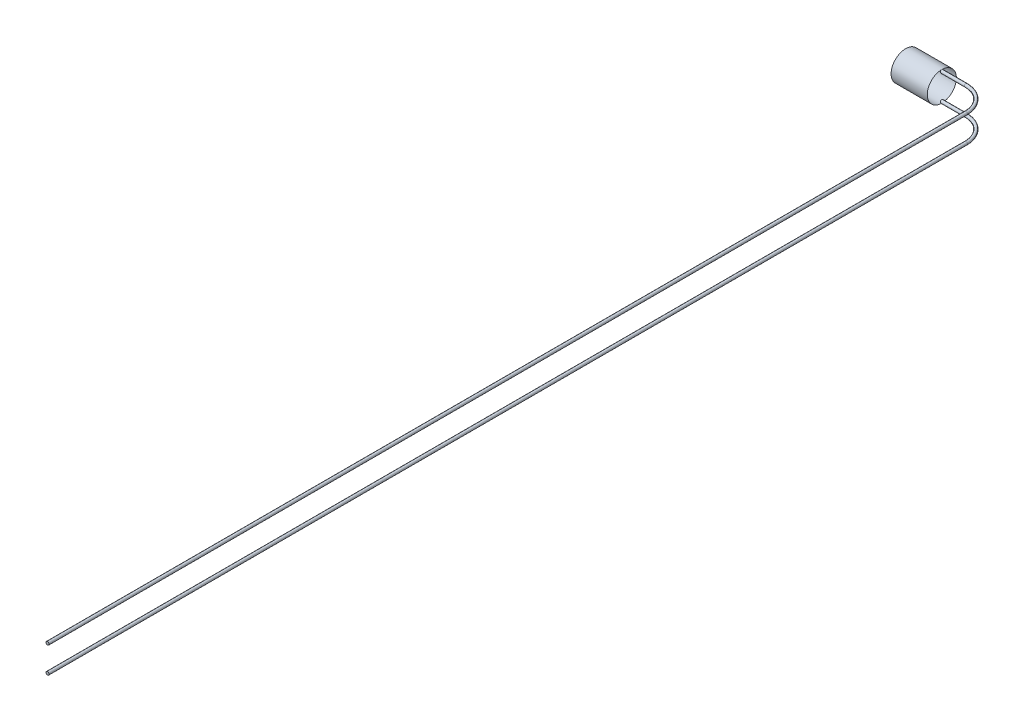
ISO-10303-21;
HEADER;
FILE_DESCRIPTION(('STEP AP214'),'2;1');
FILE_NAME('part.step','',(''),(''),'','','');
FILE_SCHEMA(('AUTOMOTIVE_DESIGN { 1 0 10303 214 1 1 1 1 }'));
ENDSEC;
DATA;
#1=APPLICATION_CONTEXT('core data for automotive mechanical design processes');
#2=APPLICATION_PROTOCOL_DEFINITION('international standard','automotive_design',2000,#1);
#3=PRODUCT_CONTEXT('',#1,'mechanical');
#4=PRODUCT('Part','Part','',(#3));
#5=PRODUCT_RELATED_PRODUCT_CATEGORY('part','',(#4));
#6=PRODUCT_DEFINITION_FORMATION('','',#4);
#7=PRODUCT_DEFINITION_CONTEXT('part definition',#1,'design');
#8=PRODUCT_DEFINITION('design','',#6,#7);
#9=PRODUCT_DEFINITION_SHAPE('','',#8);
#10=(LENGTH_UNIT() NAMED_UNIT(*) SI_UNIT(.MILLI.,.METRE.));
#11=(NAMED_UNIT(*) PLANE_ANGLE_UNIT() SI_UNIT($,.RADIAN.));
#12=(NAMED_UNIT(*) SI_UNIT($,.STERADIAN.) SOLID_ANGLE_UNIT());
#13=UNCERTAINTY_MEASURE_WITH_UNIT(LENGTH_MEASURE(1.E-05),#10,'distance_accuracy_value','');
#14=(GEOMETRIC_REPRESENTATION_CONTEXT(3) GLOBAL_UNCERTAINTY_ASSIGNED_CONTEXT((#13)) GLOBAL_UNIT_ASSIGNED_CONTEXT((#10,
#11,#12)) REPRESENTATION_CONTEXT('',''));
#15=CARTESIAN_POINT('',(0.,0.,0.));
#16=DIRECTION('',(0.,0.,1.));
#17=DIRECTION('',(1.,0.,0.));
#18=AXIS2_PLACEMENT_3D('',#15,#16,#17);
#19=CARTESIAN_POINT('',(0.,1.2065,0.));
#20=DIRECTION('',(-1.,0.,0.));
#21=DIRECTION('',(0.,0.,1.));
#22=AXIS2_PLACEMENT_3D('',#19,#20,#21);
#23=PLANE('',#22);
#24=CARTESIAN_POINT('',(0.,0.,0.));
#25=DIRECTION('',(-1.,0.,0.));
#26=DIRECTION('',(0.,0.,1.));
#27=AXIS2_PLACEMENT_3D('',#24,#25,#26);
#28=CIRCLE('',#27,1.2065);
#29=CARTESIAN_POINT('',(0.,-1.2065,0.));
#30=VERTEX_POINT('',#29);
#31=CARTESIAN_POINT('',(0.,1.2065,0.));
#32=VERTEX_POINT('',#31);
#33=EDGE_CURVE('E39',#30,#32,#28,.T.);
#34=ORIENTED_EDGE('',*,*,#33,.F.);
#35=CARTESIAN_POINT('',(0.,-1.0795,0.));
#36=DIRECTION('',(1.,0.,0.));
#37=DIRECTION('',(0.,0.,-1.));
#38=AXIS2_PLACEMENT_3D('',#35,#36,#37);
#39=CIRCLE('',#38,0.127);
#40=EDGE_CURVE('E50',#30,#30,#39,.T.);
#41=ORIENTED_EDGE('',*,*,#40,.F.);
#42=EDGE_CURVE('E11',#32,#30,#28,.T.);
#43=ORIENTED_EDGE('',*,*,#42,.F.);
#44=CARTESIAN_POINT('',(0.,1.0795,0.));
#45=DIRECTION('',(1.,0.,0.));
#46=DIRECTION('',(0.,0.,-1.));
#47=AXIS2_PLACEMENT_3D('',#44,#45,#46);
#48=CIRCLE('',#47,0.127);
#49=EDGE_CURVE('E52',#32,#32,#48,.T.);
#50=ORIENTED_EDGE('',*,*,#49,.F.);
#51=EDGE_LOOP('',(#34,#41,#43,#50));
#52=FACE_BOUND('',#51,.T.);
#53=ADVANCED_FACE('F31',(#52),#23,.F.);
#54=CARTESIAN_POINT('',(-3.,1.2065,0.));
#55=DIRECTION('',(1.,0.,0.));
#56=DIRECTION('',(0.,0.,-1.));
#57=AXIS2_PLACEMENT_3D('',#54,#55,#56);
#58=PLANE('',#57);
#59=CARTESIAN_POINT('',(-3.,0.,0.));
#60=DIRECTION('',(-1.,0.,0.));
#61=DIRECTION('',(0.,0.,1.));
#62=AXIS2_PLACEMENT_3D('',#59,#60,#61);
#63=CIRCLE('',#62,1.2065);
#64=CARTESIAN_POINT('',(-3.,0.,1.2065));
#65=VERTEX_POINT('',#64);
#66=EDGE_CURVE('E53',#65,#65,#63,.T.);
#67=ORIENTED_EDGE('',*,*,#66,.T.);
#68=EDGE_LOOP('',(#67));
#69=FACE_BOUND('',#68,.T.);
#70=ADVANCED_FACE('F33',(#69),#58,.F.);
#71=CARTESIAN_POINT('',(0.,0.,0.));
#72=DIRECTION('',(-1.,0.,0.));
#73=DIRECTION('',(0.,0.,1.));
#74=AXIS2_PLACEMENT_3D('',#71,#72,#73);
#75=CYLINDRICAL_SURFACE('',#74,1.2065);
#76=ORIENTED_EDGE('',*,*,#66,.F.);
#77=EDGE_LOOP('',(#76));
#78=FACE_BOUND('',#77,.T.);
#79=ORIENTED_EDGE('',*,*,#42,.T.);
#80=ORIENTED_EDGE('',*,*,#33,.T.);
#81=EDGE_LOOP('',(#79,#80));
#82=FACE_BOUND('',#81,.T.);
#83=ADVANCED_FACE('F45',(#78,#82),#75,.T.);
#84=CARTESIAN_POINT('',(4.,1.0795,2.));
#85=DIRECTION('',(0.,0.,1.));
#86=DIRECTION('',(1.,0.,0.));
#87=AXIS2_PLACEMENT_3D('',#84,#85,#86);
#88=CYLINDRICAL_SURFACE('',#87,0.127);
#89=CARTESIAN_POINT('',(4.,1.0795,2.));
#90=DIRECTION('',(0.,0.,1.));
#91=DIRECTION('',(1.,0.,0.));
#92=AXIS2_PLACEMENT_3D('',#89,#90,#91);
#93=CIRCLE('',#92,0.127);
#94=CARTESIAN_POINT('',(4.127,1.0795,2.));
#95=VERTEX_POINT('',#94);
#96=EDGE_CURVE('E59',#95,#95,#93,.T.);
#97=ORIENTED_EDGE('',*,*,#96,.T.);
#98=EDGE_LOOP('',(#97));
#99=FACE_BOUND('',#98,.T.);
#100=CARTESIAN_POINT('',(4.00000000000001,1.0795,78.2));
#101=DIRECTION('',(0.,0.,1.));
#102=DIRECTION('',(1.,0.,0.));
#103=AXIS2_PLACEMENT_3D('',#100,#101,#102);
#104=CIRCLE('',#103,0.127);
#105=CARTESIAN_POINT('',(4.12700000000001,1.0795,78.2));
#106=VERTEX_POINT('',#105);
#107=EDGE_CURVE('E55',#106,#106,#104,.T.);
#108=ORIENTED_EDGE('',*,*,#107,.F.);
#109=EDGE_LOOP('',(#108));
#110=FACE_BOUND('',#109,.T.);
#111=ADVANCED_FACE('F102',(#99,#110),#88,.T.);
#112=CARTESIAN_POINT('',(2.,1.0795,2.));
#113=DIRECTION('',(0.,-1.,0.));
#114=DIRECTION('',(0.,0.,-1.));
#115=AXIS2_PLACEMENT_3D('',#112,#113,#114);
#116=TOROIDAL_SURFACE('',#115,2.,0.127);
#117=CARTESIAN_POINT('',(2.,1.0795,0.));
#118=DIRECTION('',(1.,0.,0.));
#119=DIRECTION('',(0.,0.,-1.));
#120=AXIS2_PLACEMENT_3D('',#117,#118,#119);
#121=CIRCLE('',#120,0.127);
#122=CARTESIAN_POINT('',(2.,1.0795,-0.127));
#123=VERTEX_POINT('',#122);
#124=EDGE_CURVE('E64',#123,#123,#121,.T.);
#125=CARTESIAN_POINT('',(2.,1.0795,2.));
#126=DIRECTION('',(0.,-1.,0.));
#127=DIRECTION('',(0.,0.,-1.));
#128=AXIS2_PLACEMENT_3D('',#125,#126,#127);
#129=CIRCLE('',#128,2.127);
#130=EDGE_CURVE('',#123,#95,#129,.T.);
#131=ORIENTED_EDGE('',*,*,#124,.T.);
#132=ORIENTED_EDGE('',*,*,#96,.F.);
#133=ORIENTED_EDGE('',*,*,#130,.T.);
#134=ORIENTED_EDGE('',*,*,#130,.F.);
#135=EDGE_LOOP('',(#131,#133,#132,#134));
#136=FACE_BOUND('',#135,.T.);
#137=ADVANCED_FACE('F106',(#136),#116,.T.);
#138=CARTESIAN_POINT('',(2.,1.0795,0.));
#139=DIRECTION('',(-1.,0.,0.));
#140=DIRECTION('',(0.,0.,1.));
#141=AXIS2_PLACEMENT_3D('',#138,#139,#140);
#142=CYLINDRICAL_SURFACE('',#141,0.127);
#143=ORIENTED_EDGE('',*,*,#124,.F.);
#144=EDGE_LOOP('',(#143));
#145=FACE_BOUND('',#144,.T.);
#146=ORIENTED_EDGE('',*,*,#49,.T.);
#147=EDGE_LOOP('',(#146));
#148=FACE_BOUND('',#147,.T.);
#149=ADVANCED_FACE('F110',(#145,#148),#142,.T.);
#150=CARTESIAN_POINT('',(4.00000000000001,1.0795,78.2));
#151=DIRECTION('',(0.,0.,1.));
#152=DIRECTION('',(1.,0.,0.));
#153=AXIS2_PLACEMENT_3D('',#150,#151,#152);
#154=PLANE('',#153);
#155=ORIENTED_EDGE('',*,*,#107,.T.);
#156=EDGE_LOOP('',(#155));
#157=FACE_BOUND('',#156,.T.);
#158=ADVANCED_FACE('F114',(#157),#154,.T.);
#159=CARTESIAN_POINT('',(4.,-1.0795,2.));
#160=DIRECTION('',(0.,0.,1.));
#161=DIRECTION('',(1.,0.,0.));
#162=AXIS2_PLACEMENT_3D('',#159,#160,#161);
#163=CYLINDRICAL_SURFACE('',#162,0.127);
#164=CARTESIAN_POINT('',(4.,-1.0795,2.));
#165=DIRECTION('',(0.,0.,1.));
#166=DIRECTION('',(1.,0.,0.));
#167=AXIS2_PLACEMENT_3D('',#164,#165,#166);
#168=CIRCLE('',#167,0.127);
#169=CARTESIAN_POINT('',(4.127,-1.0795,2.));
#170=VERTEX_POINT('',#169);
#171=EDGE_CURVE('E71',#170,#170,#168,.T.);
#172=ORIENTED_EDGE('',*,*,#171,.T.);
#173=EDGE_LOOP('',(#172));
#174=FACE_BOUND('',#173,.T.);
#175=CARTESIAN_POINT('',(4.00000000000001,-1.0795,78.2));
#176=DIRECTION('',(0.,0.,1.));
#177=DIRECTION('',(1.,0.,0.));
#178=AXIS2_PLACEMENT_3D('',#175,#176,#177);
#179=CIRCLE('',#178,0.127);
#180=CARTESIAN_POINT('',(4.12700000000001,-1.0795,78.2));
#181=VERTEX_POINT('',#180);
#182=EDGE_CURVE('E66',#181,#181,#179,.T.);
#183=ORIENTED_EDGE('',*,*,#182,.F.);
#184=EDGE_LOOP('',(#183));
#185=FACE_BOUND('',#184,.T.);
#186=ADVANCED_FACE('F93',(#174,#185),#163,.T.);
#187=CARTESIAN_POINT('',(2.,-1.0795,2.));
#188=DIRECTION('',(0.,-1.,0.));
#189=DIRECTION('',(0.,0.,-1.));
#190=AXIS2_PLACEMENT_3D('',#187,#188,#189);
#191=TOROIDAL_SURFACE('',#190,2.,0.127);
#192=CARTESIAN_POINT('',(2.,-1.0795,0.));
#193=DIRECTION('',(1.,0.,0.));
#194=DIRECTION('',(0.,0.,-1.));
#195=AXIS2_PLACEMENT_3D('',#192,#193,#194);
#196=CIRCLE('',#195,0.127);
#197=CARTESIAN_POINT('',(2.,-1.0795,-0.127));
#198=VERTEX_POINT('',#197);
#199=EDGE_CURVE('E74',#198,#198,#196,.T.);
#200=CARTESIAN_POINT('',(2.,-1.0795,2.));
#201=DIRECTION('',(0.,-1.,0.));
#202=DIRECTION('',(0.,0.,-1.));
#203=AXIS2_PLACEMENT_3D('',#200,#201,#202);
#204=CIRCLE('',#203,2.127);
#205=EDGE_CURVE('',#198,#170,#204,.T.);
#206=ORIENTED_EDGE('',*,*,#199,.T.);
#207=ORIENTED_EDGE('',*,*,#171,.F.);
#208=ORIENTED_EDGE('',*,*,#205,.T.);
#209=ORIENTED_EDGE('',*,*,#205,.F.);
#210=EDGE_LOOP('',(#206,#208,#207,#209));
#211=FACE_BOUND('',#210,.T.);
#212=ADVANCED_FACE('F79',(#211),#191,.T.);
#213=CARTESIAN_POINT('',(2.,-1.0795,0.));
#214=DIRECTION('',(-1.,0.,0.));
#215=DIRECTION('',(0.,0.,1.));
#216=AXIS2_PLACEMENT_3D('',#213,#214,#215);
#217=CYLINDRICAL_SURFACE('',#216,0.127);
#218=ORIENTED_EDGE('',*,*,#199,.F.);
#219=EDGE_LOOP('',(#218));
#220=FACE_BOUND('',#219,.T.);
#221=ORIENTED_EDGE('',*,*,#40,.T.);
#222=EDGE_LOOP('',(#221));
#223=FACE_BOUND('',#222,.T.);
#224=ADVANCED_FACE('F82',(#220,#223),#217,.T.);
#225=CARTESIAN_POINT('',(4.00000000000001,-1.0795,78.2));
#226=DIRECTION('',(0.,0.,1.));
#227=DIRECTION('',(1.,0.,0.));
#228=AXIS2_PLACEMENT_3D('',#225,#226,#227);
#229=PLANE('',#228);
#230=ORIENTED_EDGE('',*,*,#182,.T.);
#231=EDGE_LOOP('',(#230));
#232=FACE_BOUND('',#231,.T.);
#233=ADVANCED_FACE('F85',(#232),#229,.T.);
#234=CLOSED_SHELL('',(#53,#70,#83,#111,#137,#149,#158,#186,#212,#224,#233));
#235=MANIFOLD_SOLID_BREP('B2',#234);
#236=ADVANCED_BREP_SHAPE_REPRESENTATION('',(#18,#235),#14);
#237=SHAPE_DEFINITION_REPRESENTATION(#9,#236);
ENDSEC;
END-ISO-10303-21;
